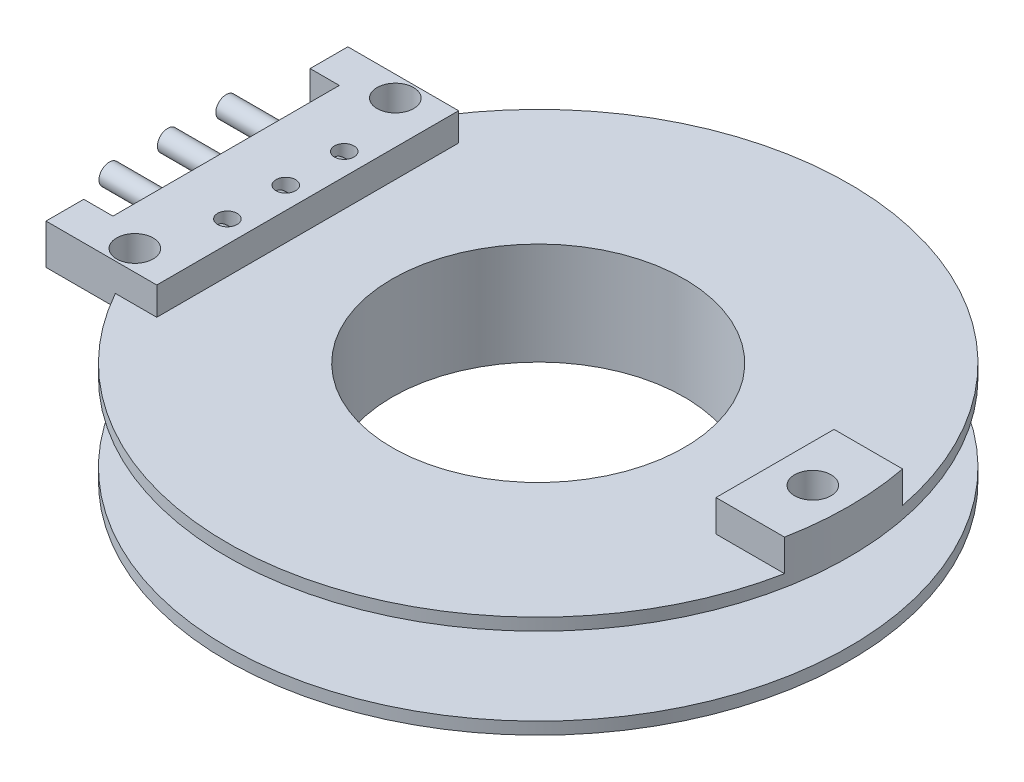
ISO-10303-21;
HEADER;
FILE_DESCRIPTION(('STEP AP214'),'2;1');
FILE_NAME('part.step','',(''),(''),'','','');
FILE_SCHEMA(('AUTOMOTIVE_DESIGN { 1 0 10303 214 1 1 1 1 }'));
ENDSEC;
DATA;
#1=APPLICATION_CONTEXT('core data for automotive mechanical design processes');
#2=APPLICATION_PROTOCOL_DEFINITION('international standard','automotive_design',2000,#1);
#3=PRODUCT_CONTEXT('',#1,'mechanical');
#4=PRODUCT('Part','Part','',(#3));
#5=PRODUCT_RELATED_PRODUCT_CATEGORY('part','',(#4));
#6=PRODUCT_DEFINITION_FORMATION('','',#4);
#7=PRODUCT_DEFINITION_CONTEXT('part definition',#1,'design');
#8=PRODUCT_DEFINITION('design','',#6,#7);
#9=PRODUCT_DEFINITION_SHAPE('','',#8);
#10=(LENGTH_UNIT() NAMED_UNIT(*) SI_UNIT(.MILLI.,.METRE.));
#11=(NAMED_UNIT(*) PLANE_ANGLE_UNIT() SI_UNIT($,.RADIAN.));
#12=(NAMED_UNIT(*) SI_UNIT($,.STERADIAN.) SOLID_ANGLE_UNIT());
#13=UNCERTAINTY_MEASURE_WITH_UNIT(LENGTH_MEASURE(1.E-05),#10,'distance_accuracy_value','');
#14=(GEOMETRIC_REPRESENTATION_CONTEXT(3) GLOBAL_UNCERTAINTY_ASSIGNED_CONTEXT((#13)) GLOBAL_UNIT_ASSIGNED_CONTEXT((#10,
#11,#12)) REPRESENTATION_CONTEXT('',''));
#15=CARTESIAN_POINT('',(0.,0.,0.));
#16=DIRECTION('',(0.,0.,1.));
#17=DIRECTION('',(1.,0.,0.));
#18=AXIS2_PLACEMENT_3D('',#15,#16,#17);
#19=CARTESIAN_POINT('',(-9.82,2.425,-2.4));
#20=DIRECTION('',(-1.,0.,0.));
#21=DIRECTION('',(0.,-1.,0.));
#22=AXIS2_PLACEMENT_3D('',#19,#20,#21);
#23=CYLINDRICAL_SURFACE('',#22,0.425);
#24=CARTESIAN_POINT('',(-9.82,2.425,-2.4));
#25=DIRECTION('',(-1.,0.,0.));
#26=DIRECTION('',(0.,-1.,0.));
#27=AXIS2_PLACEMENT_3D('',#24,#25,#26);
#28=CIRCLE('',#27,0.425);
#29=CARTESIAN_POINT('',(-9.82,2.,-2.4));
#30=VERTEX_POINT('',#29);
#31=EDGE_CURVE('E11',#30,#30,#28,.T.);
#32=ORIENTED_EDGE('',*,*,#31,.T.);
#33=EDGE_LOOP('',(#32));
#34=FACE_BOUND('',#33,.T.);
#35=CARTESIAN_POINT('',(-15.22,2.425,-2.4));
#36=DIRECTION('',(-1.,0.,0.));
#37=DIRECTION('',(0.,-1.,0.));
#38=AXIS2_PLACEMENT_3D('',#35,#36,#37);
#39=CIRCLE('',#38,0.425);
#40=CARTESIAN_POINT('',(-15.22,2.,-2.4));
#41=VERTEX_POINT('',#40);
#42=EDGE_CURVE('E49',#41,#41,#39,.T.);
#43=ORIENTED_EDGE('',*,*,#42,.F.);
#44=EDGE_LOOP('',(#43));
#45=FACE_BOUND('',#44,.T.);
#46=ADVANCED_FACE('F43',(#34,#45),#23,.T.);
#47=CARTESIAN_POINT('',(-9.82,2.425,-2.4));
#48=DIRECTION('',(-1.,0.,0.));
#49=DIRECTION('',(0.,-1.,0.));
#50=AXIS2_PLACEMENT_3D('',#47,#48,#49);
#51=PLANE('',#50);
#52=ORIENTED_EDGE('',*,*,#31,.F.);
#53=EDGE_LOOP('',(#52));
#54=FACE_BOUND('',#53,.T.);
#55=ADVANCED_FACE('F58',(#54),#51,.F.);
#56=CARTESIAN_POINT('',(-15.22,2.425,-2.4));
#57=DIRECTION('',(-1.,0.,0.));
#58=DIRECTION('',(0.,-1.,0.));
#59=AXIS2_PLACEMENT_3D('',#56,#57,#58);
#60=PLANE('',#59);
#61=ORIENTED_EDGE('',*,*,#42,.T.);
#62=EDGE_LOOP('',(#61));
#63=FACE_BOUND('',#62,.T.);
#64=ADVANCED_FACE('F55',(#63),#60,.T.);
#65=CLOSED_SHELL('',(#46,#55,#64));
#66=MANIFOLD_SOLID_BREP('B2',#65);
#67=CARTESIAN_POINT('',(-9.82,2.425,2.4));
#68=DIRECTION('',(-1.,0.,0.));
#69=DIRECTION('',(0.,-1.,0.));
#70=AXIS2_PLACEMENT_3D('',#67,#68,#69);
#71=CYLINDRICAL_SURFACE('',#70,0.425);
#72=CARTESIAN_POINT('',(-9.82,2.425,2.4));
#73=DIRECTION('',(-1.,0.,0.));
#74=DIRECTION('',(0.,-1.,0.));
#75=AXIS2_PLACEMENT_3D('',#72,#73,#74);
#76=CIRCLE('',#75,0.425);
#77=CARTESIAN_POINT('',(-9.82,2.,2.4));
#78=VERTEX_POINT('',#77);
#79=EDGE_CURVE('E42',#78,#78,#76,.T.);
#80=ORIENTED_EDGE('',*,*,#79,.T.);
#81=EDGE_LOOP('',(#80));
#82=FACE_BOUND('',#81,.T.);
#83=CARTESIAN_POINT('',(-15.22,2.425,2.4));
#84=DIRECTION('',(-1.,0.,0.));
#85=DIRECTION('',(0.,-1.,0.));
#86=AXIS2_PLACEMENT_3D('',#83,#84,#85);
#87=CIRCLE('',#86,0.425);
#88=CARTESIAN_POINT('',(-15.22,2.,2.4));
#89=VERTEX_POINT('',#88);
#90=EDGE_CURVE('E97',#89,#89,#87,.T.);
#91=ORIENTED_EDGE('',*,*,#90,.F.);
#92=EDGE_LOOP('',(#91));
#93=FACE_BOUND('',#92,.T.);
#94=ADVANCED_FACE('F91',(#82,#93),#71,.T.);
#95=CARTESIAN_POINT('',(-9.82,2.425,2.4));
#96=DIRECTION('',(-1.,0.,0.));
#97=DIRECTION('',(0.,-1.,0.));
#98=AXIS2_PLACEMENT_3D('',#95,#96,#97);
#99=PLANE('',#98);
#100=ORIENTED_EDGE('',*,*,#79,.F.);
#101=EDGE_LOOP('',(#100));
#102=FACE_BOUND('',#101,.T.);
#103=ADVANCED_FACE('F106',(#102),#99,.F.);
#104=CARTESIAN_POINT('',(-15.22,2.425,2.4));
#105=DIRECTION('',(-1.,0.,0.));
#106=DIRECTION('',(0.,-1.,0.));
#107=AXIS2_PLACEMENT_3D('',#104,#105,#106);
#108=PLANE('',#107);
#109=ORIENTED_EDGE('',*,*,#90,.T.);
#110=EDGE_LOOP('',(#109));
#111=FACE_BOUND('',#110,.T.);
#112=ADVANCED_FACE('F103',(#111),#108,.T.);
#113=CLOSED_SHELL('',(#94,#103,#112));
#114=MANIFOLD_SOLID_BREP('B6',#113);
#115=CARTESIAN_POINT('',(-9.82,2.425,0.));
#116=DIRECTION('',(-1.,0.,0.));
#117=DIRECTION('',(0.,-1.,0.));
#118=AXIS2_PLACEMENT_3D('',#115,#116,#117);
#119=CYLINDRICAL_SURFACE('',#118,0.425);
#120=CARTESIAN_POINT('',(-9.82,2.425,0.));
#121=DIRECTION('',(-1.,0.,0.));
#122=DIRECTION('',(0.,-1.,0.));
#123=AXIS2_PLACEMENT_3D('',#120,#121,#122);
#124=CIRCLE('',#123,0.425);
#125=CARTESIAN_POINT('',(-9.82,2.,0.));
#126=VERTEX_POINT('',#125);
#127=EDGE_CURVE('E90',#126,#126,#124,.T.);
#128=ORIENTED_EDGE('',*,*,#127,.T.);
#129=EDGE_LOOP('',(#128));
#130=FACE_BOUND('',#129,.T.);
#131=CARTESIAN_POINT('',(-15.22,2.425,0.));
#132=DIRECTION('',(-1.,0.,0.));
#133=DIRECTION('',(0.,-1.,0.));
#134=AXIS2_PLACEMENT_3D('',#131,#132,#133);
#135=CIRCLE('',#134,0.425);
#136=CARTESIAN_POINT('',(-15.22,2.,0.));
#137=VERTEX_POINT('',#136);
#138=EDGE_CURVE('E146',#137,#137,#135,.T.);
#139=ORIENTED_EDGE('',*,*,#138,.F.);
#140=EDGE_LOOP('',(#139));
#141=FACE_BOUND('',#140,.T.);
#142=ADVANCED_FACE('F140',(#130,#141),#119,.T.);
#143=CARTESIAN_POINT('',(-9.82,2.425,0.));
#144=DIRECTION('',(-1.,0.,0.));
#145=DIRECTION('',(0.,-1.,0.));
#146=AXIS2_PLACEMENT_3D('',#143,#144,#145);
#147=PLANE('',#146);
#148=ORIENTED_EDGE('',*,*,#127,.F.);
#149=EDGE_LOOP('',(#148));
#150=FACE_BOUND('',#149,.T.);
#151=ADVANCED_FACE('F155',(#150),#147,.F.);
#152=CARTESIAN_POINT('',(-15.22,2.425,0.));
#153=DIRECTION('',(-1.,0.,0.));
#154=DIRECTION('',(0.,-1.,0.));
#155=AXIS2_PLACEMENT_3D('',#152,#153,#154);
#156=PLANE('',#155);
#157=ORIENTED_EDGE('',*,*,#138,.T.);
#158=EDGE_LOOP('',(#157));
#159=FACE_BOUND('',#158,.T.);
#160=ADVANCED_FACE('F152',(#159),#156,.T.);
#161=CLOSED_SHELL('',(#142,#151,#160));
#162=MANIFOLD_SOLID_BREP('B37',#161);
#163=CARTESIAN_POINT('',(6.,2.1,0.));
#164=DIRECTION('',(0.,-1.,0.));
#165=DIRECTION('',(1.,0.,0.));
#166=AXIS2_PLACEMENT_3D('',#163,#164,#165);
#167=PLANE('',#166);
#168=CARTESIAN_POINT('',(0.,2.1,0.));
#169=DIRECTION('',(0.,1.,0.));
#170=DIRECTION('',(-1.,0.,0.));
#171=AXIS2_PLACEMENT_3D('',#168,#169,#170);
#172=CIRCLE('',#171,6.);
#173=CARTESIAN_POINT('',(-6.,2.1,0.));
#174=VERTEX_POINT('',#173);
#175=EDGE_CURVE('E404',#174,#174,#172,.T.);
#176=ORIENTED_EDGE('',*,*,#175,.F.);
#177=EDGE_LOOP('',(#176));
#178=FACE_BOUND('',#177,.T.);
#179=CARTESIAN_POINT('',(0.,2.1,0.));
#180=DIRECTION('',(0.,1.,0.));
#181=DIRECTION('',(-1.,0.,0.));
#182=AXIS2_PLACEMENT_3D('',#179,#180,#181);
#183=CIRCLE('',#182,12.775);
#184=CARTESIAN_POINT('',(12.5427269762201,2.1,-2.425));
#185=VERTEX_POINT('',#184);
#186=CARTESIAN_POINT('',(-11.1696295820408,2.1,-6.2));
#187=VERTEX_POINT('',#186);
#188=EDGE_CURVE('E408',#185,#187,#183,.T.);
#189=ORIENTED_EDGE('',*,*,#188,.T.);
#190=DIRECTION('',(1.,0.,0.));
#191=VECTOR('',#190,1.);
#192=CARTESIAN_POINT('',(6.,2.1,-6.2));
#193=LINE('',#192,#191);
#194=CARTESIAN_POINT('',(-9.47,2.1,-6.2));
#195=VERTEX_POINT('',#194);
#196=EDGE_CURVE('E195',#187,#195,#193,.T.);
#197=ORIENTED_EDGE('',*,*,#196,.T.);
#198=DIRECTION('',(0.,0.,1.));
#199=VECTOR('',#198,1.);
#200=CARTESIAN_POINT('',(-9.47,2.1,0.));
#201=LINE('',#200,#199);
#202=CARTESIAN_POINT('',(-9.47,2.1,6.2));
#203=VERTEX_POINT('',#202);
#204=EDGE_CURVE('E199',#195,#203,#201,.T.);
#205=ORIENTED_EDGE('',*,*,#204,.T.);
#206=DIRECTION('',(-1.,0.,0.));
#207=VECTOR('',#206,1.);
#208=CARTESIAN_POINT('',(6.,2.1,6.2));
#209=LINE('',#208,#207);
#210=CARTESIAN_POINT('',(-11.1696295820408,2.1,6.2));
#211=VERTEX_POINT('',#210);
#212=EDGE_CURVE('E344',#203,#211,#209,.T.);
#213=ORIENTED_EDGE('',*,*,#212,.T.);
#214=CARTESIAN_POINT('',(12.5427269762201,2.1,2.425));
#215=VERTEX_POINT('',#214);
#216=EDGE_CURVE('E407',#211,#215,#183,.T.);
#217=ORIENTED_EDGE('',*,*,#216,.T.);
#218=DIRECTION('',(1.,0.,0.));
#219=VECTOR('',#218,1.);
#220=CARTESIAN_POINT('',(9.72728122344574,2.1,2.425));
#221=LINE('',#220,#219);
#222=CARTESIAN_POINT('',(9.72728122344574,2.1,2.425));
#223=VERTEX_POINT('',#222);
#224=EDGE_CURVE('E364',#223,#215,#221,.T.);
#225=ORIENTED_EDGE('',*,*,#224,.F.);
#226=DIRECTION('',(0.,0.,1.));
#227=VECTOR('',#226,1.);
#228=CARTESIAN_POINT('',(9.72728122344574,2.1,-2.425));
#229=LINE('',#228,#227);
#230=CARTESIAN_POINT('',(9.72728122344574,2.1,-2.425));
#231=VERTEX_POINT('',#230);
#232=EDGE_CURVE('E373',#231,#223,#229,.T.);
#233=ORIENTED_EDGE('',*,*,#232,.F.);
#234=DIRECTION('',(-1.,0.,0.));
#235=VECTOR('',#234,1.);
#236=CARTESIAN_POINT('',(9.72728122344574,2.1,-2.425));
#237=LINE('',#236,#235);
#238=EDGE_CURVE('E359',#185,#231,#237,.T.);
#239=ORIENTED_EDGE('',*,*,#238,.F.);
#240=EDGE_LOOP('',(#189,#197,#205,#213,#217,#225,#233,#239));
#241=FACE_BOUND('',#240,.T.);
#242=ADVANCED_FACE('F180',(#178,#241),#167,.F.);
#243=CARTESIAN_POINT('',(12.775,1.6,0.));
#244=DIRECTION('',(0.,1.,0.));
#245=DIRECTION('',(-1.,0.,0.));
#246=AXIS2_PLACEMENT_3D('',#243,#244,#245);
#247=PLANE('',#246);
#248=CARTESIAN_POINT('',(11.28,1.6,0.));
#249=DIRECTION('',(0.,1.,0.));
#250=DIRECTION('',(-1.,0.,0.));
#251=AXIS2_PLACEMENT_3D('',#248,#249,#250);
#252=CIRCLE('',#251,0.75);
#253=CARTESIAN_POINT('',(10.53,1.6,0.));
#254=VERTEX_POINT('',#253);
#255=EDGE_CURVE('E742',#254,#254,#252,.F.);
#256=ORIENTED_EDGE('',*,*,#255,.F.);
#257=EDGE_LOOP('',(#256));
#258=FACE_BOUND('',#257,.T.);
#259=CARTESIAN_POINT('',(-11.22,1.59999999999999,5.35));
#260=DIRECTION('',(0.,1.,0.));
#261=DIRECTION('',(-1.,0.,0.));
#262=AXIS2_PLACEMENT_3D('',#259,#260,#261);
#263=CIRCLE('',#262,0.75);
#264=CARTESIAN_POINT('',(-11.97,1.59999999999999,5.35));
#265=VERTEX_POINT('',#264);
#266=EDGE_CURVE('E770',#265,#265,#263,.F.);
#267=ORIENTED_EDGE('',*,*,#266,.F.);
#268=EDGE_LOOP('',(#267));
#269=FACE_BOUND('',#268,.T.);
#270=CARTESIAN_POINT('',(-11.22,1.59999999999999,-5.35));
#271=DIRECTION('',(0.,1.,0.));
#272=DIRECTION('',(-1.,0.,0.));
#273=AXIS2_PLACEMENT_3D('',#270,#271,#272);
#274=CIRCLE('',#273,0.75);
#275=CARTESIAN_POINT('',(-11.97,1.59999999999999,-5.35));
#276=VERTEX_POINT('',#275);
#277=EDGE_CURVE('E306',#276,#276,#274,.F.);
#278=ORIENTED_EDGE('',*,*,#277,.F.);
#279=EDGE_LOOP('',(#278));
#280=FACE_BOUND('',#279,.T.);
#281=DIRECTION('',(-1.,0.,0.));
#282=VECTOR('',#281,1.);
#283=CARTESIAN_POINT('',(-14.02,1.6,-6.2));
#284=LINE('',#283,#282);
#285=CARTESIAN_POINT('',(-11.1696295820408,1.6,-6.2));
#286=VERTEX_POINT('',#285);
#287=CARTESIAN_POINT('',(-14.02,1.6,-6.2));
#288=VERTEX_POINT('',#287);
#289=EDGE_CURVE('E291',#286,#288,#284,.T.);
#290=ORIENTED_EDGE('',*,*,#289,.F.);
#291=CARTESIAN_POINT('',(0.,1.6,0.));
#292=DIRECTION('',(0.,1.,0.));
#293=DIRECTION('',(-1.,0.,0.));
#294=AXIS2_PLACEMENT_3D('',#291,#292,#293);
#295=CIRCLE('',#294,12.775);
#296=CARTESIAN_POINT('',(-11.1696295820408,1.6,6.2));
#297=VERTEX_POINT('',#296);
#298=EDGE_CURVE('E410',#297,#286,#295,.T.);
#299=ORIENTED_EDGE('',*,*,#298,.F.);
#300=DIRECTION('',(1.,0.,0.));
#301=VECTOR('',#300,1.);
#302=CARTESIAN_POINT('',(-9.47,1.6,6.2));
#303=LINE('',#302,#301);
#304=CARTESIAN_POINT('',(-14.02,1.6,6.2));
#305=VERTEX_POINT('',#304);
#306=EDGE_CURVE('E338',#305,#297,#303,.T.);
#307=ORIENTED_EDGE('',*,*,#306,.F.);
#308=DIRECTION('',(0.,0.,1.));
#309=VECTOR('',#308,1.);
#310=CARTESIAN_POINT('',(-14.02,1.6,6.2));
#311=LINE('',#310,#309);
#312=CARTESIAN_POINT('',(-14.02,1.6,4.65));
#313=VERTEX_POINT('',#312);
#314=EDGE_CURVE('E335',#313,#305,#311,.T.);
#315=ORIENTED_EDGE('',*,*,#314,.F.);
#316=DIRECTION('',(-1.,0.,0.));
#317=VECTOR('',#316,1.);
#318=CARTESIAN_POINT('',(-14.02,1.6,4.65));
#319=LINE('',#318,#317);
#320=CARTESIAN_POINT('',(-12.82,1.6,4.65));
#321=VERTEX_POINT('',#320);
#322=EDGE_CURVE('E332',#321,#313,#319,.T.);
#323=ORIENTED_EDGE('',*,*,#322,.F.);
#324=DIRECTION('',(0.,0.,1.));
#325=VECTOR('',#324,1.);
#326=CARTESIAN_POINT('',(-12.82,1.6,4.65));
#327=LINE('',#326,#325);
#328=CARTESIAN_POINT('',(-12.82,1.6,-4.65));
#329=VERTEX_POINT('',#328);
#330=EDGE_CURVE('E329',#329,#321,#327,.T.);
#331=ORIENTED_EDGE('',*,*,#330,.F.);
#332=DIRECTION('',(1.,0.,0.));
#333=VECTOR('',#332,1.);
#334=CARTESIAN_POINT('',(-12.82,1.6,-4.65));
#335=LINE('',#334,#333);
#336=CARTESIAN_POINT('',(-14.02,1.6,-4.65));
#337=VERTEX_POINT('',#336);
#338=EDGE_CURVE('E327',#337,#329,#335,.T.);
#339=ORIENTED_EDGE('',*,*,#338,.F.);
#340=DIRECTION('',(0.,0.,1.));
#341=VECTOR('',#340,1.);
#342=CARTESIAN_POINT('',(-14.02,1.6,-4.65));
#343=LINE('',#342,#341);
#344=EDGE_CURVE('E286',#288,#337,#343,.T.);
#345=ORIENTED_EDGE('',*,*,#344,.F.);
#346=EDGE_LOOP('',(#290,#299,#307,#315,#323,#331,#339,#345));
#347=FACE_BOUND('',#346,.T.);
#348=CARTESIAN_POINT('',(0.,1.6,0.));
#349=DIRECTION('',(0.,1.,0.));
#350=DIRECTION('',(-1.,0.,0.));
#351=AXIS2_PLACEMENT_3D('',#348,#349,#350);
#352=CIRCLE('',#351,7.);
#353=CARTESIAN_POINT('',(-7.,1.59999999999999,0.));
#354=VERTEX_POINT('',#353);
#355=EDGE_CURVE('E389',#354,#354,#352,.T.);
#356=ORIENTED_EDGE('',*,*,#355,.T.);
#357=EDGE_LOOP('',(#356));
#358=FACE_BOUND('',#357,.T.);
#359=ADVANCED_FACE('F182',(#258,#269,#280,#347,#358),#247,.F.);
#360=CARTESIAN_POINT('',(0.,2.1,0.));
#361=DIRECTION('',(0.,1.,0.));
#362=DIRECTION('',(-1.,0.,0.));
#363=AXIS2_PLACEMENT_3D('',#360,#361,#362);
#364=CYLINDRICAL_SURFACE('',#363,12.775);
#365=ORIENTED_EDGE('',*,*,#298,.T.);
#366=DIRECTION('',(0.,1.,0.));
#367=VECTOR('',#366,1.);
#368=CARTESIAN_POINT('',(-11.1696295820408,2.1,-6.2));
#369=LINE('',#368,#367);
#370=EDGE_CURVE('E138',#286,#187,#369,.T.);
#371=ORIENTED_EDGE('',*,*,#370,.T.);
#372=ORIENTED_EDGE('',*,*,#188,.F.);
#373=DIRECTION('',(0.,-1.,0.));
#374=VECTOR('',#373,1.);
#375=CARTESIAN_POINT('',(12.5427269762201,3.4,-2.425));
#376=LINE('',#375,#374);
#377=CARTESIAN_POINT('',(12.5427269762201,3.4,-2.425));
#378=VERTEX_POINT('',#377);
#379=EDGE_CURVE('E386',#378,#185,#376,.T.);
#380=ORIENTED_EDGE('',*,*,#379,.F.);
#381=CARTESIAN_POINT('',(0.,3.4,0.));
#382=DIRECTION('',(0.,1.,0.));
#383=DIRECTION('',(-1.,0.,0.));
#384=AXIS2_PLACEMENT_3D('',#381,#382,#383);
#385=CIRCLE('',#384,12.775);
#386=CARTESIAN_POINT('',(12.5427269762201,3.4,2.425));
#387=VERTEX_POINT('',#386);
#388=EDGE_CURVE('E360',#387,#378,#385,.T.);
#389=ORIENTED_EDGE('',*,*,#388,.F.);
#390=DIRECTION('',(0.,-1.,0.));
#391=VECTOR('',#390,1.);
#392=CARTESIAN_POINT('',(12.5427269762201,3.4,2.425));
#393=LINE('',#392,#391);
#394=EDGE_CURVE('E370',#387,#215,#393,.T.);
#395=ORIENTED_EDGE('',*,*,#394,.T.);
#396=ORIENTED_EDGE('',*,*,#216,.F.);
#397=DIRECTION('',(0.,1.,0.));
#398=VECTOR('',#397,1.);
#399=CARTESIAN_POINT('',(-11.1696295820408,2.1,6.2));
#400=LINE('',#399,#398);
#401=EDGE_CURVE('E188',#211,#297,#400,.F.);
#402=ORIENTED_EDGE('',*,*,#401,.T.);
#403=EDGE_LOOP('',(#365,#371,#372,#380,#389,#395,#396,#402));
#404=FACE_BOUND('',#403,.T.);
#405=ADVANCED_FACE('F415',(#404),#364,.T.);
#406=CARTESIAN_POINT('',(0.,2.1,0.));
#407=DIRECTION('',(0.,1.,0.));
#408=DIRECTION('',(-1.,0.,0.));
#409=AXIS2_PLACEMENT_3D('',#406,#407,#408);
#410=CYLINDRICAL_SURFACE('',#409,6.);
#411=CARTESIAN_POINT('',(0.,-2.1,0.));
#412=DIRECTION('',(0.,1.,0.));
#413=DIRECTION('',(-1.,0.,0.));
#414=AXIS2_PLACEMENT_3D('',#411,#412,#413);
#415=CIRCLE('',#414,6.);
#416=CARTESIAN_POINT('',(-6.,-2.1,0.));
#417=VERTEX_POINT('',#416);
#418=EDGE_CURVE('E401',#417,#417,#415,.T.);
#419=ORIENTED_EDGE('',*,*,#418,.F.);
#420=EDGE_LOOP('',(#419));
#421=FACE_BOUND('',#420,.T.);
#422=ORIENTED_EDGE('',*,*,#175,.T.);
#423=EDGE_LOOP('',(#422));
#424=FACE_BOUND('',#423,.T.);
#425=ADVANCED_FACE('F477',(#421,#424),#410,.F.);
#426=CARTESIAN_POINT('',(12.775,-2.1,0.));
#427=DIRECTION('',(0.,1.,0.));
#428=DIRECTION('',(-1.,0.,0.));
#429=AXIS2_PLACEMENT_3D('',#426,#427,#428);
#430=PLANE('',#429);
#431=CARTESIAN_POINT('',(0.,-2.1,0.));
#432=DIRECTION('',(0.,1.,0.));
#433=DIRECTION('',(-1.,0.,0.));
#434=AXIS2_PLACEMENT_3D('',#431,#432,#433);
#435=CIRCLE('',#434,12.775);
#436=CARTESIAN_POINT('',(-12.775,-2.1,0.));
#437=VERTEX_POINT('',#436);
#438=EDGE_CURVE('E398',#437,#437,#435,.T.);
#439=ORIENTED_EDGE('',*,*,#438,.F.);
#440=EDGE_LOOP('',(#439));
#441=FACE_BOUND('',#440,.T.);
#442=ORIENTED_EDGE('',*,*,#418,.T.);
#443=EDGE_LOOP('',(#442));
#444=FACE_BOUND('',#443,.T.);
#445=ADVANCED_FACE('F483',(#441,#444),#430,.F.);
#446=CARTESIAN_POINT('',(0.,2.1,0.));
#447=DIRECTION('',(0.,1.,0.));
#448=DIRECTION('',(-1.,0.,0.));
#449=AXIS2_PLACEMENT_3D('',#446,#447,#448);
#450=CYLINDRICAL_SURFACE('',#449,12.775);
#451=CARTESIAN_POINT('',(0.,-1.6,0.));
#452=DIRECTION('',(0.,1.,0.));
#453=DIRECTION('',(-1.,0.,0.));
#454=AXIS2_PLACEMENT_3D('',#451,#452,#453);
#455=CIRCLE('',#454,12.775);
#456=CARTESIAN_POINT('',(-12.775,-1.6,0.));
#457=VERTEX_POINT('',#456);
#458=EDGE_CURVE('E395',#457,#457,#455,.T.);
#459=ORIENTED_EDGE('',*,*,#458,.F.);
#460=EDGE_LOOP('',(#459));
#461=FACE_BOUND('',#460,.T.);
#462=ORIENTED_EDGE('',*,*,#438,.T.);
#463=EDGE_LOOP('',(#462));
#464=FACE_BOUND('',#463,.T.);
#465=ADVANCED_FACE('F488',(#461,#464),#450,.T.);
#466=CARTESIAN_POINT('',(7.,-1.6,0.));
#467=DIRECTION('',(0.,-1.,0.));
#468=DIRECTION('',(1.,0.,0.));
#469=AXIS2_PLACEMENT_3D('',#466,#467,#468);
#470=PLANE('',#469);
#471=CARTESIAN_POINT('',(0.,-1.6,0.));
#472=DIRECTION('',(0.,1.,0.));
#473=DIRECTION('',(-1.,0.,0.));
#474=AXIS2_PLACEMENT_3D('',#471,#472,#473);
#475=CIRCLE('',#474,7.);
#476=CARTESIAN_POINT('',(-7.,-1.6,0.));
#477=VERTEX_POINT('',#476);
#478=EDGE_CURVE('E392',#477,#477,#475,.T.);
#479=ORIENTED_EDGE('',*,*,#478,.F.);
#480=EDGE_LOOP('',(#479));
#481=FACE_BOUND('',#480,.T.);
#482=ORIENTED_EDGE('',*,*,#458,.T.);
#483=EDGE_LOOP('',(#482));
#484=FACE_BOUND('',#483,.T.);
#485=ADVANCED_FACE('F496',(#481,#484),#470,.F.);
#486=CARTESIAN_POINT('',(0.,2.1,0.));
#487=DIRECTION('',(0.,1.,0.));
#488=DIRECTION('',(-1.,0.,0.));
#489=AXIS2_PLACEMENT_3D('',#486,#487,#488);
#490=CYLINDRICAL_SURFACE('',#489,7.);
#491=ORIENTED_EDGE('',*,*,#355,.F.);
#492=EDGE_LOOP('',(#491));
#493=FACE_BOUND('',#492,.T.);
#494=ORIENTED_EDGE('',*,*,#478,.T.);
#495=EDGE_LOOP('',(#494));
#496=FACE_BOUND('',#495,.T.);
#497=ADVANCED_FACE('F503',(#493,#496),#490,.T.);
#498=CARTESIAN_POINT('',(9.72728122344574,3.4,-2.425));
#499=DIRECTION('',(0.,0.,1.));
#500=DIRECTION('',(1.,0.,0.));
#501=AXIS2_PLACEMENT_3D('',#498,#499,#500);
#502=PLANE('',#501);
#503=ORIENTED_EDGE('',*,*,#238,.T.);
#504=DIRECTION('',(0.,-1.,0.));
#505=VECTOR('',#504,1.);
#506=CARTESIAN_POINT('',(9.72728122344574,3.4,-2.425));
#507=LINE('',#506,#505);
#508=CARTESIAN_POINT('',(9.72728122344574,3.4,-2.425));
#509=VERTEX_POINT('',#508);
#510=EDGE_CURVE('E383',#509,#231,#507,.T.);
#511=ORIENTED_EDGE('',*,*,#510,.F.);
#512=DIRECTION('',(-1.,0.,0.));
#513=VECTOR('',#512,1.);
#514=CARTESIAN_POINT('',(9.72728122344574,3.4,-2.425));
#515=LINE('',#514,#513);
#516=EDGE_CURVE('E363',#378,#509,#515,.T.);
#517=ORIENTED_EDGE('',*,*,#516,.F.);
#518=ORIENTED_EDGE('',*,*,#379,.T.);
#519=EDGE_LOOP('',(#503,#511,#517,#518));
#520=FACE_BOUND('',#519,.T.);
#521=ADVANCED_FACE('F442',(#520),#502,.F.);
#522=CARTESIAN_POINT('',(9.72728122344574,3.4,-2.425));
#523=DIRECTION('',(1.,0.,0.));
#524=DIRECTION('',(0.,1.,0.));
#525=AXIS2_PLACEMENT_3D('',#522,#523,#524);
#526=PLANE('',#525);
#527=ORIENTED_EDGE('',*,*,#232,.T.);
#528=DIRECTION('',(0.,-1.,0.));
#529=VECTOR('',#528,1.);
#530=CARTESIAN_POINT('',(9.72728122344574,3.4,2.425));
#531=LINE('',#530,#529);
#532=CARTESIAN_POINT('',(9.72728122344574,3.4,2.425));
#533=VERTEX_POINT('',#532);
#534=EDGE_CURVE('E380',#533,#223,#531,.T.);
#535=ORIENTED_EDGE('',*,*,#534,.F.);
#536=DIRECTION('',(0.,0.,1.));
#537=VECTOR('',#536,1.);
#538=CARTESIAN_POINT('',(9.72728122344574,3.4,-2.425));
#539=LINE('',#538,#537);
#540=EDGE_CURVE('E366',#509,#533,#539,.T.);
#541=ORIENTED_EDGE('',*,*,#540,.F.);
#542=ORIENTED_EDGE('',*,*,#510,.T.);
#543=EDGE_LOOP('',(#527,#535,#541,#542));
#544=FACE_BOUND('',#543,.T.);
#545=ADVANCED_FACE('F445',(#544),#526,.F.);
#546=CARTESIAN_POINT('',(9.72728122344574,3.4,2.425));
#547=DIRECTION('',(0.,0.,-1.));
#548=DIRECTION('',(-1.,0.,0.));
#549=AXIS2_PLACEMENT_3D('',#546,#547,#548);
#550=PLANE('',#549);
#551=ORIENTED_EDGE('',*,*,#224,.T.);
#552=ORIENTED_EDGE('',*,*,#394,.F.);
#553=DIRECTION('',(1.,0.,0.));
#554=VECTOR('',#553,1.);
#555=CARTESIAN_POINT('',(9.72728122344574,3.4,2.425));
#556=LINE('',#555,#554);
#557=EDGE_CURVE('E368',#533,#387,#556,.T.);
#558=ORIENTED_EDGE('',*,*,#557,.F.);
#559=ORIENTED_EDGE('',*,*,#534,.T.);
#560=EDGE_LOOP('',(#551,#552,#558,#559));
#561=FACE_BOUND('',#560,.T.);
#562=ADVANCED_FACE('F453',(#561),#550,.F.);
#563=CARTESIAN_POINT('',(0.,3.4,0.));
#564=DIRECTION('',(0.,1.,0.));
#565=DIRECTION('',(-1.,0.,0.));
#566=AXIS2_PLACEMENT_3D('',#563,#564,#565);
#567=PLANE('',#566);
#568=CARTESIAN_POINT('',(11.28,3.4,0.));
#569=DIRECTION('',(0.,1.,0.));
#570=DIRECTION('',(-1.,0.,0.));
#571=AXIS2_PLACEMENT_3D('',#568,#569,#570);
#572=CIRCLE('',#571,0.75);
#573=CARTESIAN_POINT('',(10.53,3.4,0.));
#574=VERTEX_POINT('',#573);
#575=EDGE_CURVE('E745',#574,#574,#572,.T.);
#576=ORIENTED_EDGE('',*,*,#575,.F.);
#577=EDGE_LOOP('',(#576));
#578=FACE_BOUND('',#577,.T.);
#579=ORIENTED_EDGE('',*,*,#388,.T.);
#580=ORIENTED_EDGE('',*,*,#516,.T.);
#581=ORIENTED_EDGE('',*,*,#540,.T.);
#582=ORIENTED_EDGE('',*,*,#557,.T.);
#583=EDGE_LOOP('',(#579,#580,#581,#582));
#584=FACE_BOUND('',#583,.T.);
#585=ADVANCED_FACE('F449',(#578,#584),#567,.T.);
#586=CARTESIAN_POINT('',(-9.47,1.6,-6.2));
#587=DIRECTION('',(1.,0.,0.));
#588=DIRECTION('',(0.,1.,0.));
#589=AXIS2_PLACEMENT_3D('',#586,#587,#588);
#590=PLANE('',#589);
#591=ORIENTED_EDGE('',*,*,#204,.F.);
#592=DIRECTION('',(0.,1.,0.));
#593=VECTOR('',#592,1.);
#594=CARTESIAN_POINT('',(-9.47,1.6,-6.2));
#595=LINE('',#594,#593);
#596=CARTESIAN_POINT('',(-9.47,3.25,-6.2));
#597=VERTEX_POINT('',#596);
#598=EDGE_CURVE('E345',#195,#597,#595,.T.);
#599=ORIENTED_EDGE('',*,*,#598,.T.);
#600=DIRECTION('',(0.,0.,-1.));
#601=VECTOR('',#600,1.);
#602=CARTESIAN_POINT('',(-9.47,3.25,-6.2));
#603=LINE('',#602,#601);
#604=CARTESIAN_POINT('',(-9.47,3.25,6.2));
#605=VERTEX_POINT('',#604);
#606=EDGE_CURVE('E323',#605,#597,#603,.T.);
#607=ORIENTED_EDGE('',*,*,#606,.F.);
#608=DIRECTION('',(0.,1.,0.));
#609=VECTOR('',#608,1.);
#610=CARTESIAN_POINT('',(-9.47,1.6,6.2));
#611=LINE('',#610,#609);
#612=EDGE_CURVE('E347',#203,#605,#611,.T.);
#613=ORIENTED_EDGE('',*,*,#612,.F.);
#614=EDGE_LOOP('',(#591,#599,#607,#613));
#615=FACE_BOUND('',#614,.T.);
#616=ADVANCED_FACE('F457',(#615),#590,.T.);
#617=CARTESIAN_POINT('',(-14.02,1.6,-6.2));
#618=DIRECTION('',(0.,0.,-1.));
#619=DIRECTION('',(-1.,0.,0.));
#620=AXIS2_PLACEMENT_3D('',#617,#618,#619);
#621=PLANE('',#620);
#622=ORIENTED_EDGE('',*,*,#196,.F.);
#623=ORIENTED_EDGE('',*,*,#370,.F.);
#624=ORIENTED_EDGE('',*,*,#289,.T.);
#625=DIRECTION('',(0.,1.,0.));
#626=VECTOR('',#625,1.);
#627=CARTESIAN_POINT('',(-14.02,1.6,-6.2));
#628=LINE('',#627,#626);
#629=CARTESIAN_POINT('',(-14.02,3.25,-6.2));
#630=VERTEX_POINT('',#629);
#631=EDGE_CURVE('E342',#288,#630,#628,.T.);
#632=ORIENTED_EDGE('',*,*,#631,.T.);
#633=DIRECTION('',(-1.,0.,0.));
#634=VECTOR('',#633,1.);
#635=CARTESIAN_POINT('',(-14.02,3.25,-6.2));
#636=LINE('',#635,#634);
#637=EDGE_CURVE('E305',#597,#630,#636,.T.);
#638=ORIENTED_EDGE('',*,*,#637,.F.);
#639=ORIENTED_EDGE('',*,*,#598,.F.);
#640=EDGE_LOOP('',(#622,#623,#624,#632,#638,#639));
#641=FACE_BOUND('',#640,.T.);
#642=ADVANCED_FACE('F436',(#641),#621,.T.);
#643=CARTESIAN_POINT('',(-9.47,1.6,6.2));
#644=DIRECTION('',(0.,0.,1.));
#645=DIRECTION('',(1.,0.,0.));
#646=AXIS2_PLACEMENT_3D('',#643,#644,#645);
#647=PLANE('',#646);
#648=ORIENTED_EDGE('',*,*,#212,.F.);
#649=ORIENTED_EDGE('',*,*,#612,.T.);
#650=DIRECTION('',(1.,0.,0.));
#651=VECTOR('',#650,1.);
#652=CARTESIAN_POINT('',(-9.47,3.25,6.2));
#653=LINE('',#652,#651);
#654=CARTESIAN_POINT('',(-14.02,3.25,6.2));
#655=VERTEX_POINT('',#654);
#656=EDGE_CURVE('E320',#655,#605,#653,.T.);
#657=ORIENTED_EDGE('',*,*,#656,.F.);
#658=DIRECTION('',(0.,1.,0.));
#659=VECTOR('',#658,1.);
#660=CARTESIAN_POINT('',(-14.02,1.6,6.2));
#661=LINE('',#660,#659);
#662=EDGE_CURVE('E349',#305,#655,#661,.T.);
#663=ORIENTED_EDGE('',*,*,#662,.F.);
#664=ORIENTED_EDGE('',*,*,#306,.T.);
#665=ORIENTED_EDGE('',*,*,#401,.F.);
#666=EDGE_LOOP('',(#648,#649,#657,#663,#664,#665));
#667=FACE_BOUND('',#666,.T.);
#668=ADVANCED_FACE('F419',(#667),#647,.T.);
#669=CARTESIAN_POINT('',(-14.02,1.6,-4.65));
#670=DIRECTION('',(-1.,0.,0.));
#671=DIRECTION('',(0.,-1.,0.));
#672=AXIS2_PLACEMENT_3D('',#669,#670,#671);
#673=PLANE('',#672);
#674=DIRECTION('',(0.,1.,0.));
#675=VECTOR('',#674,1.);
#676=CARTESIAN_POINT('',(-14.02,1.6,-4.65));
#677=LINE('',#676,#675);
#678=CARTESIAN_POINT('',(-14.02,3.25,-4.65));
#679=VERTEX_POINT('',#678);
#680=EDGE_CURVE('E279',#337,#679,#677,.T.);
#681=ORIENTED_EDGE('',*,*,#680,.T.);
#682=DIRECTION('',(0.,0.,1.));
#683=VECTOR('',#682,1.);
#684=CARTESIAN_POINT('',(-14.02,3.25,-4.65));
#685=LINE('',#684,#683);
#686=EDGE_CURVE('E284',#630,#679,#685,.T.);
#687=ORIENTED_EDGE('',*,*,#686,.F.);
#688=ORIENTED_EDGE('',*,*,#631,.F.);
#689=ORIENTED_EDGE('',*,*,#344,.T.);
#690=EDGE_LOOP('',(#681,#687,#688,#689));
#691=FACE_BOUND('',#690,.T.);
#692=ADVANCED_FACE('F281',(#691),#673,.T.);
#693=CARTESIAN_POINT('',(-14.02,1.6,6.2));
#694=DIRECTION('',(-1.,0.,0.));
#695=DIRECTION('',(0.,-1.,0.));
#696=AXIS2_PLACEMENT_3D('',#693,#694,#695);
#697=PLANE('',#696);
#698=ORIENTED_EDGE('',*,*,#662,.T.);
#699=DIRECTION('',(0.,0.,1.));
#700=VECTOR('',#699,1.);
#701=CARTESIAN_POINT('',(-14.02,3.25,6.2));
#702=LINE('',#701,#700);
#703=CARTESIAN_POINT('',(-14.02,3.25,4.65));
#704=VERTEX_POINT('',#703);
#705=EDGE_CURVE('E317',#704,#655,#702,.T.);
#706=ORIENTED_EDGE('',*,*,#705,.F.);
#707=DIRECTION('',(0.,1.,0.));
#708=VECTOR('',#707,1.);
#709=CARTESIAN_POINT('',(-14.02,1.6,4.65));
#710=LINE('',#709,#708);
#711=EDGE_CURVE('E351',#313,#704,#710,.T.);
#712=ORIENTED_EDGE('',*,*,#711,.F.);
#713=ORIENTED_EDGE('',*,*,#314,.T.);
#714=EDGE_LOOP('',(#698,#706,#712,#713));
#715=FACE_BOUND('',#714,.T.);
#716=ADVANCED_FACE('F427',(#715),#697,.T.);
#717=CARTESIAN_POINT('',(-14.02,1.6,4.65));
#718=DIRECTION('',(0.,0.,-1.));
#719=DIRECTION('',(-1.,0.,0.));
#720=AXIS2_PLACEMENT_3D('',#717,#718,#719);
#721=PLANE('',#720);
#722=ORIENTED_EDGE('',*,*,#711,.T.);
#723=DIRECTION('',(-1.,0.,0.));
#724=VECTOR('',#723,1.);
#725=CARTESIAN_POINT('',(-14.02,3.25,4.65));
#726=LINE('',#725,#724);
#727=CARTESIAN_POINT('',(-12.82,3.25,4.65));
#728=VERTEX_POINT('',#727);
#729=EDGE_CURVE('E314',#728,#704,#726,.T.);
#730=ORIENTED_EDGE('',*,*,#729,.F.);
#731=DIRECTION('',(0.,1.,0.));
#732=VECTOR('',#731,1.);
#733=CARTESIAN_POINT('',(-12.82,1.6,4.65));
#734=LINE('',#733,#732);
#735=EDGE_CURVE('E353',#321,#728,#734,.T.);
#736=ORIENTED_EDGE('',*,*,#735,.F.);
#737=ORIENTED_EDGE('',*,*,#322,.T.);
#738=EDGE_LOOP('',(#722,#730,#736,#737));
#739=FACE_BOUND('',#738,.T.);
#740=ADVANCED_FACE('F431',(#739),#721,.T.);
#741=CARTESIAN_POINT('',(-12.82,1.6,4.65));
#742=DIRECTION('',(-1.,0.,0.));
#743=DIRECTION('',(0.,-1.,0.));
#744=AXIS2_PLACEMENT_3D('',#741,#742,#743);
#745=PLANE('',#744);
#746=ORIENTED_EDGE('',*,*,#735,.T.);
#747=DIRECTION('',(0.,0.,1.));
#748=VECTOR('',#747,1.);
#749=CARTESIAN_POINT('',(-12.82,3.25,4.65));
#750=LINE('',#749,#748);
#751=CARTESIAN_POINT('',(-12.82,3.25,-4.65));
#752=VERTEX_POINT('',#751);
#753=EDGE_CURVE('E299',#752,#728,#750,.T.);
#754=ORIENTED_EDGE('',*,*,#753,.F.);
#755=DIRECTION('',(0.,1.,0.));
#756=VECTOR('',#755,1.);
#757=CARTESIAN_POINT('',(-12.82,1.6,-4.65));
#758=LINE('',#757,#756);
#759=EDGE_CURVE('E290',#329,#752,#758,.T.);
#760=ORIENTED_EDGE('',*,*,#759,.F.);
#761=ORIENTED_EDGE('',*,*,#330,.T.);
#762=EDGE_LOOP('',(#746,#754,#760,#761));
#763=FACE_BOUND('',#762,.T.);
#764=ADVANCED_FACE('F433',(#763),#745,.T.);
#765=CARTESIAN_POINT('',(-12.82,1.6,-4.65));
#766=DIRECTION('',(0.,0.,1.));
#767=DIRECTION('',(1.,0.,0.));
#768=AXIS2_PLACEMENT_3D('',#765,#766,#767);
#769=PLANE('',#768);
#770=ORIENTED_EDGE('',*,*,#759,.T.);
#771=DIRECTION('',(1.,0.,0.));
#772=VECTOR('',#771,1.);
#773=CARTESIAN_POINT('',(-12.82,3.25,-4.65));
#774=LINE('',#773,#772);
#775=EDGE_CURVE('E294',#679,#752,#774,.T.);
#776=ORIENTED_EDGE('',*,*,#775,.F.);
#777=ORIENTED_EDGE('',*,*,#680,.F.);
#778=ORIENTED_EDGE('',*,*,#338,.T.);
#779=EDGE_LOOP('',(#770,#776,#777,#778));
#780=FACE_BOUND('',#779,.T.);
#781=ADVANCED_FACE('F295',(#780),#769,.T.);
#782=CARTESIAN_POINT('',(0.,3.25,0.));
#783=DIRECTION('',(0.,-1.,0.));
#784=DIRECTION('',(1.,0.,0.));
#785=AXIS2_PLACEMENT_3D('',#782,#783,#784);
#786=PLANE('',#785);
#787=CARTESIAN_POINT('',(-10.37,3.25,0.));
#788=DIRECTION('',(0.,1.,0.));
#789=DIRECTION('',(-1.,0.,0.));
#790=AXIS2_PLACEMENT_3D('',#787,#788,#789);
#791=CIRCLE('',#790,0.4);
#792=CARTESIAN_POINT('',(-10.77,3.25,0.));
#793=VERTEX_POINT('',#792);
#794=EDGE_CURVE('E754',#793,#793,#791,.T.);
#795=ORIENTED_EDGE('',*,*,#794,.F.);
#796=EDGE_LOOP('',(#795));
#797=FACE_BOUND('',#796,.T.);
#798=CARTESIAN_POINT('',(-10.37,3.25,2.4));
#799=DIRECTION('',(0.,1.,0.));
#800=DIRECTION('',(-1.,0.,0.));
#801=AXIS2_PLACEMENT_3D('',#798,#799,#800);
#802=CIRCLE('',#801,0.399999999999999);
#803=CARTESIAN_POINT('',(-10.77,3.25,2.4));
#804=VERTEX_POINT('',#803);
#805=EDGE_CURVE('E747',#804,#804,#802,.T.);
#806=ORIENTED_EDGE('',*,*,#805,.F.);
#807=EDGE_LOOP('',(#806));
#808=FACE_BOUND('',#807,.T.);
#809=CARTESIAN_POINT('',(-10.37,3.25,-2.4));
#810=DIRECTION('',(0.,1.,0.));
#811=DIRECTION('',(-1.,0.,0.));
#812=AXIS2_PLACEMENT_3D('',#809,#810,#811);
#813=CIRCLE('',#812,0.399999999999999);
#814=CARTESIAN_POINT('',(-10.77,3.25,-2.4));
#815=VERTEX_POINT('',#814);
#816=EDGE_CURVE('E753',#815,#815,#813,.T.);
#817=ORIENTED_EDGE('',*,*,#816,.F.);
#818=EDGE_LOOP('',(#817));
#819=FACE_BOUND('',#818,.T.);
#820=CARTESIAN_POINT('',(-11.22,3.25,5.35));
#821=DIRECTION('',(0.,1.,0.));
#822=DIRECTION('',(-1.,0.,0.));
#823=AXIS2_PLACEMENT_3D('',#820,#821,#822);
#824=CIRCLE('',#823,0.75);
#825=CARTESIAN_POINT('',(-11.97,3.25,5.35));
#826=VERTEX_POINT('',#825);
#827=EDGE_CURVE('E765',#826,#826,#824,.T.);
#828=ORIENTED_EDGE('',*,*,#827,.F.);
#829=EDGE_LOOP('',(#828));
#830=FACE_BOUND('',#829,.T.);
#831=CARTESIAN_POINT('',(-11.22,3.25,-5.35));
#832=DIRECTION('',(0.,1.,0.));
#833=DIRECTION('',(-1.,0.,0.));
#834=AXIS2_PLACEMENT_3D('',#831,#832,#833);
#835=CIRCLE('',#834,0.75);
#836=CARTESIAN_POINT('',(-11.97,3.25,-5.35));
#837=VERTEX_POINT('',#836);
#838=EDGE_CURVE('E309',#837,#837,#835,.T.);
#839=ORIENTED_EDGE('',*,*,#838,.F.);
#840=EDGE_LOOP('',(#839));
#841=FACE_BOUND('',#840,.T.);
#842=ORIENTED_EDGE('',*,*,#686,.T.);
#843=ORIENTED_EDGE('',*,*,#775,.T.);
#844=ORIENTED_EDGE('',*,*,#753,.T.);
#845=ORIENTED_EDGE('',*,*,#729,.T.);
#846=ORIENTED_EDGE('',*,*,#705,.T.);
#847=ORIENTED_EDGE('',*,*,#656,.T.);
#848=ORIENTED_EDGE('',*,*,#606,.T.);
#849=ORIENTED_EDGE('',*,*,#637,.T.);
#850=EDGE_LOOP('',(#842,#843,#844,#845,#846,#847,#848,#849));
#851=FACE_BOUND('',#850,.T.);
#852=ADVANCED_FACE('F302',(#797,#808,#819,#830,#841,#851),#786,.F.);
#853=CARTESIAN_POINT('',(-11.22,-0.52132034355965,-5.35));
#854=DIRECTION('',(0.,1.,0.));
#855=DIRECTION('',(-1.,0.,0.));
#856=AXIS2_PLACEMENT_3D('',#853,#854,#855);
#857=CYLINDRICAL_SURFACE('',#856,0.75);
#858=ORIENTED_EDGE('',*,*,#277,.T.);
#859=EDGE_LOOP('',(#858));
#860=FACE_BOUND('',#859,.T.);
#861=ORIENTED_EDGE('',*,*,#838,.T.);
#862=EDGE_LOOP('',(#861));
#863=FACE_BOUND('',#862,.T.);
#864=ADVANCED_FACE('F555',(#860,#863),#857,.F.);
#865=CARTESIAN_POINT('',(-11.22,-0.52132034355965,5.35));
#866=DIRECTION('',(0.,1.,0.));
#867=DIRECTION('',(-1.,0.,0.));
#868=AXIS2_PLACEMENT_3D('',#865,#866,#867);
#869=CYLINDRICAL_SURFACE('',#868,0.75);
#870=ORIENTED_EDGE('',*,*,#266,.T.);
#871=EDGE_LOOP('',(#870));
#872=FACE_BOUND('',#871,.T.);
#873=ORIENTED_EDGE('',*,*,#827,.T.);
#874=EDGE_LOOP('',(#873));
#875=FACE_BOUND('',#874,.T.);
#876=ADVANCED_FACE('F564',(#872,#875),#869,.F.);
#877=CARTESIAN_POINT('',(-10.37,1.7,-2.4));
#878=DIRECTION('',(0.,1.,0.));
#879=DIRECTION('',(-1.,0.,0.));
#880=AXIS2_PLACEMENT_3D('',#877,#878,#879);
#881=CYLINDRICAL_SURFACE('',#880,0.399999999999999);
#882=CARTESIAN_POINT('',(-10.37,1.7,-2.4));
#883=DIRECTION('',(0.,1.,0.));
#884=DIRECTION('',(-1.,0.,0.));
#885=AXIS2_PLACEMENT_3D('',#882,#883,#884);
#886=CIRCLE('',#885,0.399999999999999);
#887=CARTESIAN_POINT('',(-10.77,1.7,-2.4));
#888=VERTEX_POINT('',#887);
#889=EDGE_CURVE('E762',#888,#888,#886,.T.);
#890=ORIENTED_EDGE('',*,*,#889,.F.);
#891=EDGE_LOOP('',(#890));
#892=FACE_BOUND('',#891,.T.);
#893=ORIENTED_EDGE('',*,*,#816,.T.);
#894=EDGE_LOOP('',(#893));
#895=FACE_BOUND('',#894,.T.);
#896=ADVANCED_FACE('F571',(#892,#895),#881,.F.);
#897=CARTESIAN_POINT('',(-10.37,1.7,-2.4));
#898=DIRECTION('',(0.,1.,0.));
#899=DIRECTION('',(-1.,0.,0.));
#900=AXIS2_PLACEMENT_3D('',#897,#898,#899);
#901=PLANE('',#900);
#902=ORIENTED_EDGE('',*,*,#889,.T.);
#903=EDGE_LOOP('',(#902));
#904=FACE_BOUND('',#903,.T.);
#905=ADVANCED_FACE('F578',(#904),#901,.T.);
#906=CARTESIAN_POINT('',(-10.37,1.7,2.4));
#907=DIRECTION('',(0.,1.,0.));
#908=DIRECTION('',(-1.,0.,0.));
#909=AXIS2_PLACEMENT_3D('',#906,#907,#908);
#910=CYLINDRICAL_SURFACE('',#909,0.399999999999999);
#911=CARTESIAN_POINT('',(-10.37,1.7,2.4));
#912=DIRECTION('',(0.,1.,0.));
#913=DIRECTION('',(-1.,0.,0.));
#914=AXIS2_PLACEMENT_3D('',#911,#912,#913);
#915=CIRCLE('',#914,0.399999999999999);
#916=CARTESIAN_POINT('',(-10.77,1.7,2.4));
#917=VERTEX_POINT('',#916);
#918=EDGE_CURVE('E757',#917,#917,#915,.T.);
#919=ORIENTED_EDGE('',*,*,#918,.F.);
#920=EDGE_LOOP('',(#919));
#921=FACE_BOUND('',#920,.T.);
#922=ORIENTED_EDGE('',*,*,#805,.T.);
#923=EDGE_LOOP('',(#922));
#924=FACE_BOUND('',#923,.T.);
#925=ADVANCED_FACE('F586',(#921,#924),#910,.F.);
#926=CARTESIAN_POINT('',(-10.37,1.7,2.4));
#927=DIRECTION('',(0.,1.,0.));
#928=DIRECTION('',(-1.,0.,0.));
#929=AXIS2_PLACEMENT_3D('',#926,#927,#928);
#930=PLANE('',#929);
#931=ORIENTED_EDGE('',*,*,#918,.T.);
#932=EDGE_LOOP('',(#931));
#933=FACE_BOUND('',#932,.T.);
#934=ADVANCED_FACE('F594',(#933),#930,.T.);
#935=CARTESIAN_POINT('',(-10.37,1.7,0.));
#936=DIRECTION('',(0.,1.,0.));
#937=DIRECTION('',(-1.,0.,0.));
#938=AXIS2_PLACEMENT_3D('',#935,#936,#937);
#939=CYLINDRICAL_SURFACE('',#938,0.4);
#940=CARTESIAN_POINT('',(-10.37,1.7,0.));
#941=DIRECTION('',(0.,1.,0.));
#942=DIRECTION('',(-1.,0.,0.));
#943=AXIS2_PLACEMENT_3D('',#940,#941,#942);
#944=CIRCLE('',#943,0.4);
#945=CARTESIAN_POINT('',(-10.77,1.7,0.));
#946=VERTEX_POINT('',#945);
#947=EDGE_CURVE('E750',#946,#946,#944,.T.);
#948=ORIENTED_EDGE('',*,*,#947,.F.);
#949=EDGE_LOOP('',(#948));
#950=FACE_BOUND('',#949,.T.);
#951=ORIENTED_EDGE('',*,*,#794,.T.);
#952=EDGE_LOOP('',(#951));
#953=FACE_BOUND('',#952,.T.);
#954=ADVANCED_FACE('F602',(#950,#953),#939,.F.);
#955=CARTESIAN_POINT('',(-10.37,1.7,0.));
#956=DIRECTION('',(0.,1.,0.));
#957=DIRECTION('',(-1.,0.,0.));
#958=AXIS2_PLACEMENT_3D('',#955,#956,#957);
#959=PLANE('',#958);
#960=ORIENTED_EDGE('',*,*,#947,.T.);
#961=EDGE_LOOP('',(#960));
#962=FACE_BOUND('',#961,.T.);
#963=ADVANCED_FACE('F610',(#962),#959,.T.);
#964=CARTESIAN_POINT('',(11.28,-0.521320343559647,0.));
#965=DIRECTION('',(0.,1.,0.));
#966=DIRECTION('',(-1.,0.,0.));
#967=AXIS2_PLACEMENT_3D('',#964,#965,#966);
#968=CYLINDRICAL_SURFACE('',#967,0.75);
#969=ORIENTED_EDGE('',*,*,#255,.T.);
#970=EDGE_LOOP('',(#969));
#971=FACE_BOUND('',#970,.T.);
#972=ORIENTED_EDGE('',*,*,#575,.T.);
#973=EDGE_LOOP('',(#972));
#974=FACE_BOUND('',#973,.T.);
#975=ADVANCED_FACE('F618',(#971,#974),#968,.F.);
#976=CLOSED_SHELL('',(#242,#359,#405,#425,#445,#465,#485,#497,#521,#545,#562,#585,#616,#642,
#668,#692,#716,#740,#764,#781,#852,#864,#876,#896,#905,#925,#934,#954,#963,#975));
#977=MANIFOLD_SOLID_BREP('B85',#976);
#978=ADVANCED_BREP_SHAPE_REPRESENTATION('',(#18,#66,#114,#162,#977),#14);
#979=SHAPE_DEFINITION_REPRESENTATION(#9,#978);
ENDSEC;
END-ISO-10303-21;
